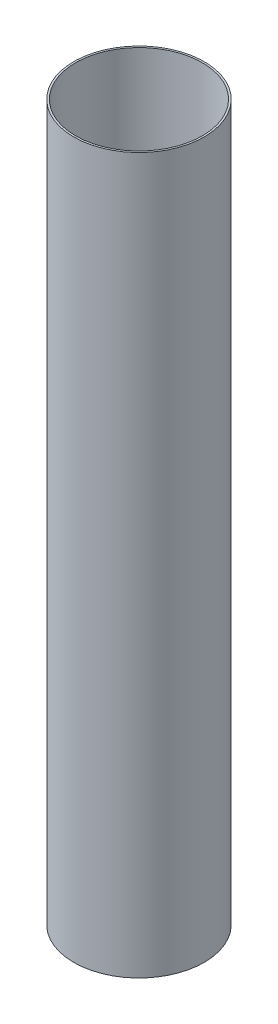
ISO-10303-21;
HEADER;
FILE_DESCRIPTION(('STEP AP214'),'2;1');
FILE_NAME('part.step','',(''),(''),'','','');
FILE_SCHEMA(('AUTOMOTIVE_DESIGN { 1 0 10303 214 1 1 1 1 }'));
ENDSEC;
DATA;
#1=APPLICATION_CONTEXT('core data for automotive mechanical design processes');
#2=APPLICATION_PROTOCOL_DEFINITION('international standard','automotive_design',2000,#1);
#3=PRODUCT_CONTEXT('',#1,'mechanical');
#4=PRODUCT('Part','Part','',(#3));
#5=PRODUCT_RELATED_PRODUCT_CATEGORY('part','',(#4));
#6=PRODUCT_DEFINITION_FORMATION('','',#4);
#7=PRODUCT_DEFINITION_CONTEXT('part definition',#1,'design');
#8=PRODUCT_DEFINITION('design','',#6,#7);
#9=PRODUCT_DEFINITION_SHAPE('','',#8);
#10=(LENGTH_UNIT() NAMED_UNIT(*) SI_UNIT(.MILLI.,.METRE.));
#11=(NAMED_UNIT(*) PLANE_ANGLE_UNIT() SI_UNIT($,.RADIAN.));
#12=(NAMED_UNIT(*) SI_UNIT($,.STERADIAN.) SOLID_ANGLE_UNIT());
#13=UNCERTAINTY_MEASURE_WITH_UNIT(LENGTH_MEASURE(1.E-05),#10,'distance_accuracy_value','');
#14=(GEOMETRIC_REPRESENTATION_CONTEXT(3) GLOBAL_UNCERTAINTY_ASSIGNED_CONTEXT((#13)) GLOBAL_UNIT_ASSIGNED_CONTEXT((#10,
#11,#12)) REPRESENTATION_CONTEXT('',''));
#15=CARTESIAN_POINT('',(0.,0.,0.));
#16=DIRECTION('',(0.,0.,1.));
#17=DIRECTION('',(1.,0.,0.));
#18=AXIS2_PLACEMENT_3D('',#15,#16,#17);
#19=CARTESIAN_POINT('',(0.,558.8,0.));
#20=DIRECTION('',(0.,1.,0.));
#21=DIRECTION('',(0.,0.,1.));
#22=AXIS2_PLACEMENT_3D('',#19,#20,#21);
#23=PLANE('',#22);
#24=CARTESIAN_POINT('',(0.,558.8,0.));
#25=DIRECTION('',(0.,1.,0.));
#26=DIRECTION('',(0.,0.,1.));
#27=AXIS2_PLACEMENT_3D('',#24,#25,#26);
#28=CIRCLE('',#27,51.);
#29=CARTESIAN_POINT('',(0.,558.8,51.));
#30=VERTEX_POINT('',#29);
#31=EDGE_CURVE('E10',#30,#30,#28,.T.);
#32=ORIENTED_EDGE('',*,*,#31,.T.);
#33=EDGE_LOOP('',(#32));
#34=FACE_BOUND('',#33,.T.);
#35=CARTESIAN_POINT('',(0.,558.8,0.));
#36=DIRECTION('',(0.,1.,0.));
#37=DIRECTION('',(0.,0.,1.));
#38=AXIS2_PLACEMENT_3D('',#35,#36,#37);
#39=CIRCLE('',#38,49.55);
#40=CARTESIAN_POINT('',(0.,558.8,49.55));
#41=VERTEX_POINT('',#40);
#42=EDGE_CURVE('E42',#41,#41,#39,.T.);
#43=ORIENTED_EDGE('',*,*,#42,.F.);
#44=EDGE_LOOP('',(#43));
#45=FACE_BOUND('',#44,.T.);
#46=ADVANCED_FACE('F31',(#34,#45),#23,.T.);
#47=CARTESIAN_POINT('',(0.,0.,0.));
#48=DIRECTION('',(0.,1.,0.));
#49=DIRECTION('',(0.,0.,1.));
#50=AXIS2_PLACEMENT_3D('',#47,#48,#49);
#51=PLANE('',#50);
#52=CARTESIAN_POINT('',(0.,0.,0.));
#53=DIRECTION('',(0.,1.,0.));
#54=DIRECTION('',(0.,0.,1.));
#55=AXIS2_PLACEMENT_3D('',#52,#53,#54);
#56=CIRCLE('',#55,51.);
#57=CARTESIAN_POINT('',(0.,0.,51.));
#58=VERTEX_POINT('',#57);
#59=EDGE_CURVE('E35',#58,#58,#56,.T.);
#60=ORIENTED_EDGE('',*,*,#59,.F.);
#61=EDGE_LOOP('',(#60));
#62=FACE_BOUND('',#61,.T.);
#63=CARTESIAN_POINT('',(0.,0.,0.));
#64=DIRECTION('',(0.,1.,0.));
#65=DIRECTION('',(0.,0.,1.));
#66=AXIS2_PLACEMENT_3D('',#63,#64,#65);
#67=CIRCLE('',#66,49.55);
#68=CARTESIAN_POINT('',(0.,0.,49.55));
#69=VERTEX_POINT('',#68);
#70=EDGE_CURVE('E44',#69,#69,#67,.T.);
#71=ORIENTED_EDGE('',*,*,#70,.T.);
#72=EDGE_LOOP('',(#71));
#73=FACE_BOUND('',#72,.T.);
#74=ADVANCED_FACE('F54',(#62,#73),#51,.F.);
#75=CARTESIAN_POINT('',(0.,558.8,0.));
#76=DIRECTION('',(0.,-1.,0.));
#77=DIRECTION('',(0.,0.,-1.));
#78=AXIS2_PLACEMENT_3D('',#75,#76,#77);
#79=CYLINDRICAL_SURFACE('',#78,51.);
#80=ORIENTED_EDGE('',*,*,#31,.F.);
#81=EDGE_LOOP('',(#80));
#82=FACE_BOUND('',#81,.T.);
#83=ORIENTED_EDGE('',*,*,#59,.T.);
#84=EDGE_LOOP('',(#83));
#85=FACE_BOUND('',#84,.T.);
#86=ADVANCED_FACE('F33',(#82,#85),#79,.T.);
#87=CARTESIAN_POINT('',(0.,558.8,0.));
#88=DIRECTION('',(0.,-1.,0.));
#89=DIRECTION('',(0.,0.,-1.));
#90=AXIS2_PLACEMENT_3D('',#87,#88,#89);
#91=CYLINDRICAL_SURFACE('',#90,49.55);
#92=ORIENTED_EDGE('',*,*,#42,.T.);
#93=EDGE_LOOP('',(#92));
#94=FACE_BOUND('',#93,.T.);
#95=ORIENTED_EDGE('',*,*,#70,.F.);
#96=EDGE_LOOP('',(#95));
#97=FACE_BOUND('',#96,.T.);
#98=ADVANCED_FACE('F50',(#94,#97),#91,.F.);
#99=CLOSED_SHELL('',(#46,#74,#86,#98));
#100=MANIFOLD_SOLID_BREP('B2',#99);
#101=ADVANCED_BREP_SHAPE_REPRESENTATION('',(#18,#100),#14);
#102=SHAPE_DEFINITION_REPRESENTATION(#9,#101);
ENDSEC;
END-ISO-10303-21;
